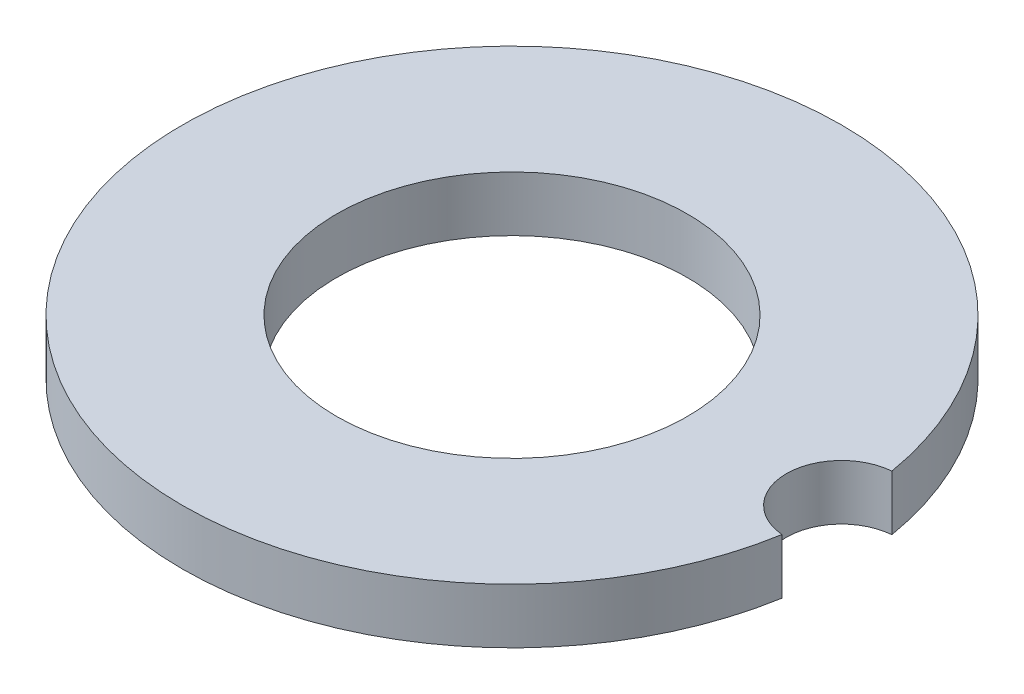
ISO-10303-21;
HEADER;
FILE_DESCRIPTION(('STEP AP214'),'2;1');
FILE_NAME('part.step','',(''),(''),'','','');
FILE_SCHEMA(('AUTOMOTIVE_DESIGN { 1 0 10303 214 1 1 1 1 }'));
ENDSEC;
DATA;
#1=APPLICATION_CONTEXT('core data for automotive mechanical design processes');
#2=APPLICATION_PROTOCOL_DEFINITION('international standard','automotive_design',2000,#1);
#3=PRODUCT_CONTEXT('',#1,'mechanical');
#4=PRODUCT('Part','Part','',(#3));
#5=PRODUCT_RELATED_PRODUCT_CATEGORY('part','',(#4));
#6=PRODUCT_DEFINITION_FORMATION('','',#4);
#7=PRODUCT_DEFINITION_CONTEXT('part definition',#1,'design');
#8=PRODUCT_DEFINITION('design','',#6,#7);
#9=PRODUCT_DEFINITION_SHAPE('','',#8);
#10=(LENGTH_UNIT() NAMED_UNIT(*) SI_UNIT(.MILLI.,.METRE.));
#11=(NAMED_UNIT(*) PLANE_ANGLE_UNIT() SI_UNIT($,.RADIAN.));
#12=(NAMED_UNIT(*) SI_UNIT($,.STERADIAN.) SOLID_ANGLE_UNIT());
#13=UNCERTAINTY_MEASURE_WITH_UNIT(LENGTH_MEASURE(1.E-05),#10,'distance_accuracy_value','');
#14=(GEOMETRIC_REPRESENTATION_CONTEXT(3) GLOBAL_UNCERTAINTY_ASSIGNED_CONTEXT((#13)) GLOBAL_UNIT_ASSIGNED_CONTEXT((#10,
#11,#12)) REPRESENTATION_CONTEXT('',''));
#15=CARTESIAN_POINT('',(0.,0.,0.));
#16=DIRECTION('',(0.,0.,1.));
#17=DIRECTION('',(1.,0.,0.));
#18=AXIS2_PLACEMENT_3D('',#15,#16,#17);
#19=CARTESIAN_POINT('',(0.,12.7,0.));
#20=DIRECTION('',(0.,-1.,0.));
#21=DIRECTION('',(0.,0.,-1.));
#22=AXIS2_PLACEMENT_3D('',#19,#20,#21);
#23=CYLINDRICAL_SURFACE('',#22,75.9206);
#24=CARTESIAN_POINT('',(0.,0.,0.));
#25=DIRECTION('',(0.,1.,0.));
#26=DIRECTION('',(0.,0.,1.));
#27=AXIS2_PLACEMENT_3D('',#24,#25,#26);
#28=CIRCLE('',#27,75.9206);
#29=CARTESIAN_POINT('',(74.8578577116092,0.,-12.6585403261382));
#30=VERTEX_POINT('',#29);
#31=CARTESIAN_POINT('',(74.8578577116092,0.,12.6585403261382));
#32=VERTEX_POINT('',#31);
#33=EDGE_CURVE('E73',#30,#32,#28,.T.);
#34=ORIENTED_EDGE('',*,*,#33,.T.);
#35=DIRECTION('',(0.,1.,0.));
#36=VECTOR('',#35,1.);
#37=CARTESIAN_POINT('',(74.8578577116092,6.35,12.6585403261382));
#38=LINE('',#37,#36);
#39=CARTESIAN_POINT('',(74.8578577116092,12.7,12.6585403261382));
#40=VERTEX_POINT('',#39);
#41=EDGE_CURVE('E52',#32,#40,#38,.T.);
#42=ORIENTED_EDGE('',*,*,#41,.T.);
#43=CARTESIAN_POINT('',(0.,12.7,0.));
#44=DIRECTION('',(0.,1.,0.));
#45=DIRECTION('',(0.,0.,1.));
#46=AXIS2_PLACEMENT_3D('',#43,#44,#45);
#47=CIRCLE('',#46,75.9206);
#48=CARTESIAN_POINT('',(74.8578577116092,12.7,-12.6585403261382));
#49=VERTEX_POINT('',#48);
#50=EDGE_CURVE('E45',#49,#40,#47,.T.);
#51=ORIENTED_EDGE('',*,*,#50,.F.);
#52=DIRECTION('',(0.,1.,0.));
#53=VECTOR('',#52,1.);
#54=CARTESIAN_POINT('',(74.8578577116092,6.35,-12.6585403261382));
#55=LINE('',#54,#53);
#56=EDGE_CURVE('E59',#49,#30,#55,.F.);
#57=ORIENTED_EDGE('',*,*,#56,.T.);
#58=EDGE_LOOP('',(#34,#42,#51,#57));
#59=FACE_BOUND('',#58,.T.);
#60=ADVANCED_FACE('F38',(#59),#23,.T.);
#61=CARTESIAN_POINT('',(0.,12.7,0.));
#62=DIRECTION('',(0.,1.,0.));
#63=DIRECTION('',(0.,0.,1.));
#64=AXIS2_PLACEMENT_3D('',#61,#62,#63);
#65=PLANE('',#64);
#66=CARTESIAN_POINT('',(75.9206,12.7,0.));
#67=DIRECTION('',(0.,1.,0.));
#68=DIRECTION('',(0.,0.,1.));
#69=AXIS2_PLACEMENT_3D('',#66,#67,#68);
#70=CIRCLE('',#69,12.7030730282086);
#71=EDGE_CURVE('E62',#49,#40,#70,.T.);
#72=ORIENTED_EDGE('',*,*,#71,.F.);
#73=ORIENTED_EDGE('',*,*,#50,.T.);
#74=EDGE_LOOP('',(#72,#73));
#75=FACE_BOUND('',#74,.T.);
#76=CARTESIAN_POINT('',(0.,12.7,0.));
#77=DIRECTION('',(0.,1.,0.));
#78=DIRECTION('',(0.,0.,1.));
#79=AXIS2_PLACEMENT_3D('',#76,#77,#78);
#80=CIRCLE('',#79,40.4114);
#81=CARTESIAN_POINT('',(0.,12.7,40.4114));
#82=VERTEX_POINT('',#81);
#83=EDGE_CURVE('E75',#82,#82,#80,.T.);
#84=ORIENTED_EDGE('',*,*,#83,.F.);
#85=EDGE_LOOP('',(#84));
#86=FACE_BOUND('',#85,.T.);
#87=ADVANCED_FACE('F70',(#75,#86),#65,.T.);
#88=CARTESIAN_POINT('',(0.,0.,0.));
#89=DIRECTION('',(0.,1.,0.));
#90=DIRECTION('',(0.,0.,1.));
#91=AXIS2_PLACEMENT_3D('',#88,#89,#90);
#92=PLANE('',#91);
#93=CARTESIAN_POINT('',(0.,0.,0.));
#94=DIRECTION('',(0.,1.,0.));
#95=DIRECTION('',(0.,0.,1.));
#96=AXIS2_PLACEMENT_3D('',#93,#94,#95);
#97=CIRCLE('',#96,40.4114);
#98=CARTESIAN_POINT('',(0.,0.,40.4114));
#99=VERTEX_POINT('',#98);
#100=EDGE_CURVE('E77',#99,#99,#97,.T.);
#101=ORIENTED_EDGE('',*,*,#100,.T.);
#102=EDGE_LOOP('',(#101));
#103=FACE_BOUND('',#102,.T.);
#104=ORIENTED_EDGE('',*,*,#33,.F.);
#105=CARTESIAN_POINT('',(75.9206,0.,0.));
#106=DIRECTION('',(0.,1.,0.));
#107=DIRECTION('',(0.,0.,1.));
#108=AXIS2_PLACEMENT_3D('',#105,#106,#107);
#109=CIRCLE('',#108,12.7030730282086);
#110=EDGE_CURVE('E11',#30,#32,#109,.T.);
#111=ORIENTED_EDGE('',*,*,#110,.T.);
#112=EDGE_LOOP('',(#104,#111));
#113=FACE_BOUND('',#112,.T.);
#114=ADVANCED_FACE('F87',(#103,#113),#92,.F.);
#115=CARTESIAN_POINT('',(0.,12.7,0.));
#116=DIRECTION('',(0.,-1.,0.));
#117=DIRECTION('',(0.,0.,-1.));
#118=AXIS2_PLACEMENT_3D('',#115,#116,#117);
#119=CYLINDRICAL_SURFACE('',#118,40.4114);
#120=ORIENTED_EDGE('',*,*,#83,.T.);
#121=EDGE_LOOP('',(#120));
#122=FACE_BOUND('',#121,.T.);
#123=ORIENTED_EDGE('',*,*,#100,.F.);
#124=EDGE_LOOP('',(#123));
#125=FACE_BOUND('',#124,.T.);
#126=ADVANCED_FACE('F84',(#122,#125),#119,.F.);
#127=CARTESIAN_POINT('',(75.9206,0.,0.));
#128=DIRECTION('',(0.,1.,0.));
#129=DIRECTION('',(0.,0.,1.));
#130=AXIS2_PLACEMENT_3D('',#127,#128,#129);
#131=CYLINDRICAL_SURFACE('',#130,12.7030730282086);
#132=ORIENTED_EDGE('',*,*,#110,.F.);
#133=ORIENTED_EDGE('',*,*,#56,.F.);
#134=ORIENTED_EDGE('',*,*,#71,.T.);
#135=ORIENTED_EDGE('',*,*,#41,.F.);
#136=EDGE_LOOP('',(#132,#133,#134,#135));
#137=FACE_BOUND('',#136,.T.);
#138=ADVANCED_FACE('F61',(#137),#131,.F.);
#139=CLOSED_SHELL('',(#60,#87,#114,#126,#138));
#140=MANIFOLD_SOLID_BREP('B2',#139);
#141=ADVANCED_BREP_SHAPE_REPRESENTATION('',(#18,#140),#14);
#142=SHAPE_DEFINITION_REPRESENTATION(#9,#141);
ENDSEC;
END-ISO-10303-21;
